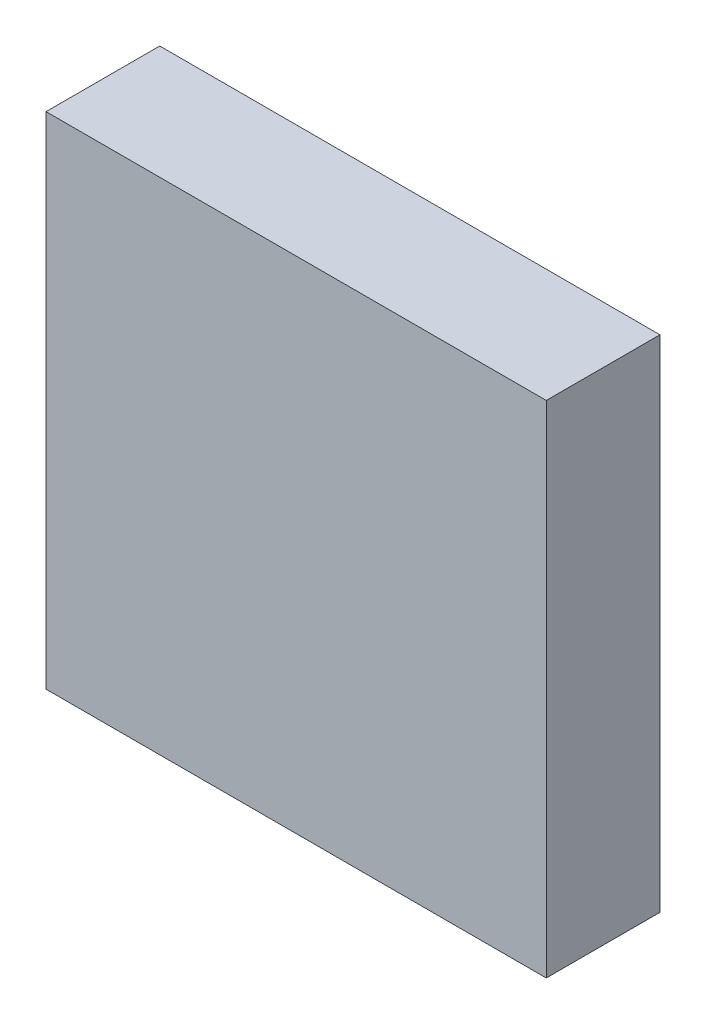
ISO-10303-21;
HEADER;
FILE_DESCRIPTION(('STEP AP214'),'2;1');
FILE_NAME('part.step','',(''),(''),'','','');
FILE_SCHEMA(('AUTOMOTIVE_DESIGN { 1 0 10303 214 1 1 1 1 }'));
ENDSEC;
DATA;
#1=APPLICATION_CONTEXT('core data for automotive mechanical design processes');
#2=APPLICATION_PROTOCOL_DEFINITION('international standard','automotive_design',2000,#1);
#3=PRODUCT_CONTEXT('',#1,'mechanical');
#4=PRODUCT('Part','Part','',(#3));
#5=PRODUCT_RELATED_PRODUCT_CATEGORY('part','',(#4));
#6=PRODUCT_DEFINITION_FORMATION('','',#4);
#7=PRODUCT_DEFINITION_CONTEXT('part definition',#1,'design');
#8=PRODUCT_DEFINITION('design','',#6,#7);
#9=PRODUCT_DEFINITION_SHAPE('','',#8);
#10=(LENGTH_UNIT() NAMED_UNIT(*) SI_UNIT(.MILLI.,.METRE.));
#11=(NAMED_UNIT(*) PLANE_ANGLE_UNIT() SI_UNIT($,.RADIAN.));
#12=(NAMED_UNIT(*) SI_UNIT($,.STERADIAN.) SOLID_ANGLE_UNIT());
#13=UNCERTAINTY_MEASURE_WITH_UNIT(LENGTH_MEASURE(1.E-05),#10,'distance_accuracy_value','');
#14=(GEOMETRIC_REPRESENTATION_CONTEXT(3) GLOBAL_UNCERTAINTY_ASSIGNED_CONTEXT((#13)) GLOBAL_UNIT_ASSIGNED_CONTEXT((#10,
#11,#12)) REPRESENTATION_CONTEXT('',''));
#15=CARTESIAN_POINT('',(0.,0.,0.));
#16=DIRECTION('',(0.,0.,1.));
#17=DIRECTION('',(1.,0.,0.));
#18=AXIS2_PLACEMENT_3D('',#15,#16,#17);
#19=CARTESIAN_POINT('',(5.5,-5.5,1.25));
#20=DIRECTION('',(-1.,0.,0.));
#21=DIRECTION('',(0.,0.,1.));
#22=AXIS2_PLACEMENT_3D('',#19,#20,#21);
#23=PLANE('',#22);
#24=DIRECTION('',(0.,1.,0.));
#25=VECTOR('',#24,1.);
#26=CARTESIAN_POINT('',(5.5,-5.5,-1.25));
#27=LINE('',#26,#25);
#28=CARTESIAN_POINT('',(5.5,-5.5,-1.25));
#29=VERTEX_POINT('',#28);
#30=CARTESIAN_POINT('',(5.5,5.5,-1.25));
#31=VERTEX_POINT('',#30);
#32=EDGE_CURVE('E96',#29,#31,#27,.T.);
#33=ORIENTED_EDGE('',*,*,#32,.T.);
#34=DIRECTION('',(0.,0.,-1.));
#35=VECTOR('',#34,1.);
#36=CARTESIAN_POINT('',(5.5,5.5,1.25));
#37=LINE('',#36,#35);
#38=CARTESIAN_POINT('',(5.5,5.5,1.25));
#39=VERTEX_POINT('',#38);
#40=EDGE_CURVE('E11',#39,#31,#37,.T.);
#41=ORIENTED_EDGE('',*,*,#40,.F.);
#42=DIRECTION('',(0.,1.,0.));
#43=VECTOR('',#42,1.);
#44=CARTESIAN_POINT('',(5.5,-5.5,1.25));
#45=LINE('',#44,#43);
#46=CARTESIAN_POINT('',(5.5,-5.5,1.25));
#47=VERTEX_POINT('',#46);
#48=EDGE_CURVE('E84',#47,#39,#45,.T.);
#49=ORIENTED_EDGE('',*,*,#48,.F.);
#50=DIRECTION('',(0.,0.,-1.));
#51=VECTOR('',#50,1.);
#52=CARTESIAN_POINT('',(5.5,-5.5,1.25));
#53=LINE('',#52,#51);
#54=EDGE_CURVE('E92',#47,#29,#53,.T.);
#55=ORIENTED_EDGE('',*,*,#54,.T.);
#56=EDGE_LOOP('',(#33,#41,#49,#55));
#57=FACE_BOUND('',#56,.T.);
#58=ADVANCED_FACE('F33',(#57),#23,.F.);
#59=CARTESIAN_POINT('',(-5.5,5.5,1.25));
#60=DIRECTION('',(0.,-1.,0.));
#61=DIRECTION('',(0.,0.,-1.));
#62=AXIS2_PLACEMENT_3D('',#59,#60,#61);
#63=PLANE('',#62);
#64=DIRECTION('',(-1.,0.,0.));
#65=VECTOR('',#64,1.);
#66=CARTESIAN_POINT('',(-5.5,5.5,-1.25));
#67=LINE('',#66,#65);
#68=CARTESIAN_POINT('',(-5.5,5.5,-1.25));
#69=VERTEX_POINT('',#68);
#70=EDGE_CURVE('E88',#31,#69,#67,.T.);
#71=ORIENTED_EDGE('',*,*,#70,.T.);
#72=DIRECTION('',(0.,0.,-1.));
#73=VECTOR('',#72,1.);
#74=CARTESIAN_POINT('',(-5.5,5.5,1.25));
#75=LINE('',#74,#73);
#76=CARTESIAN_POINT('',(-5.5,5.5,1.25));
#77=VERTEX_POINT('',#76);
#78=EDGE_CURVE('E41',#77,#69,#75,.T.);
#79=ORIENTED_EDGE('',*,*,#78,.F.);
#80=DIRECTION('',(-1.,0.,0.));
#81=VECTOR('',#80,1.);
#82=CARTESIAN_POINT('',(-5.5,5.5,1.25));
#83=LINE('',#82,#81);
#84=EDGE_CURVE('E79',#39,#77,#83,.T.);
#85=ORIENTED_EDGE('',*,*,#84,.F.);
#86=ORIENTED_EDGE('',*,*,#40,.T.);
#87=EDGE_LOOP('',(#71,#79,#85,#86));
#88=FACE_BOUND('',#87,.T.);
#89=ADVANCED_FACE('F87',(#88),#63,.F.);
#90=CARTESIAN_POINT('',(-5.5,-5.5,1.25));
#91=DIRECTION('',(1.,0.,0.));
#92=DIRECTION('',(0.,0.,-1.));
#93=AXIS2_PLACEMENT_3D('',#90,#91,#92);
#94=PLANE('',#93);
#95=DIRECTION('',(0.,-1.,0.));
#96=VECTOR('',#95,1.);
#97=CARTESIAN_POINT('',(-5.5,-5.5,-1.25));
#98=LINE('',#97,#96);
#99=CARTESIAN_POINT('',(-5.5,-5.5,-1.25));
#100=VERTEX_POINT('',#99);
#101=EDGE_CURVE('E66',#69,#100,#98,.T.);
#102=ORIENTED_EDGE('',*,*,#101,.T.);
#103=DIRECTION('',(0.,0.,-1.));
#104=VECTOR('',#103,1.);
#105=CARTESIAN_POINT('',(-5.5,-5.5,1.25));
#106=LINE('',#105,#104);
#107=CARTESIAN_POINT('',(-5.5,-5.5,1.25));
#108=VERTEX_POINT('',#107);
#109=EDGE_CURVE('E89',#108,#100,#106,.T.);
#110=ORIENTED_EDGE('',*,*,#109,.F.);
#111=DIRECTION('',(0.,-1.,0.));
#112=VECTOR('',#111,1.);
#113=CARTESIAN_POINT('',(-5.5,-5.5,1.25));
#114=LINE('',#113,#112);
#115=EDGE_CURVE('E82',#77,#108,#114,.T.);
#116=ORIENTED_EDGE('',*,*,#115,.F.);
#117=ORIENTED_EDGE('',*,*,#78,.T.);
#118=EDGE_LOOP('',(#102,#110,#116,#117));
#119=FACE_BOUND('',#118,.T.);
#120=ADVANCED_FACE('F90',(#119),#94,.F.);
#121=CARTESIAN_POINT('',(-5.5,-5.5,1.25));
#122=DIRECTION('',(0.,1.,0.));
#123=DIRECTION('',(0.,0.,1.));
#124=AXIS2_PLACEMENT_3D('',#121,#122,#123);
#125=PLANE('',#124);
#126=DIRECTION('',(1.,0.,0.));
#127=VECTOR('',#126,1.);
#128=CARTESIAN_POINT('',(-5.5,-5.5,-1.25));
#129=LINE('',#128,#127);
#130=EDGE_CURVE('E72',#100,#29,#129,.T.);
#131=ORIENTED_EDGE('',*,*,#130,.T.);
#132=ORIENTED_EDGE('',*,*,#54,.F.);
#133=DIRECTION('',(1.,0.,0.));
#134=VECTOR('',#133,1.);
#135=CARTESIAN_POINT('',(-5.5,-5.5,1.25));
#136=LINE('',#135,#134);
#137=EDGE_CURVE('E49',#108,#47,#136,.T.);
#138=ORIENTED_EDGE('',*,*,#137,.F.);
#139=ORIENTED_EDGE('',*,*,#109,.T.);
#140=EDGE_LOOP('',(#131,#132,#138,#139));
#141=FACE_BOUND('',#140,.T.);
#142=ADVANCED_FACE('F103',(#141),#125,.F.);
#143=CARTESIAN_POINT('',(0.,0.,1.25));
#144=DIRECTION('',(0.,0.,-1.));
#145=DIRECTION('',(-1.,0.,0.));
#146=AXIS2_PLACEMENT_3D('',#143,#144,#145);
#147=PLANE('',#146);
#148=ORIENTED_EDGE('',*,*,#48,.T.);
#149=ORIENTED_EDGE('',*,*,#84,.T.);
#150=ORIENTED_EDGE('',*,*,#115,.T.);
#151=ORIENTED_EDGE('',*,*,#137,.T.);
#152=EDGE_LOOP('',(#148,#149,#150,#151));
#153=FACE_BOUND('',#152,.T.);
#154=ADVANCED_FACE('F80',(#153),#147,.F.);
#155=CARTESIAN_POINT('',(0.,0.,-1.25));
#156=DIRECTION('',(0.,0.,-1.));
#157=DIRECTION('',(-1.,0.,0.));
#158=AXIS2_PLACEMENT_3D('',#155,#156,#157);
#159=PLANE('',#158);
#160=ORIENTED_EDGE('',*,*,#32,.F.);
#161=ORIENTED_EDGE('',*,*,#130,.F.);
#162=ORIENTED_EDGE('',*,*,#101,.F.);
#163=ORIENTED_EDGE('',*,*,#70,.F.);
#164=EDGE_LOOP('',(#160,#161,#162,#163));
#165=FACE_BOUND('',#164,.T.);
#166=ADVANCED_FACE('F106',(#165),#159,.T.);
#167=CLOSED_SHELL('',(#58,#89,#120,#142,#154,#166));
#168=MANIFOLD_SOLID_BREP('B2',#167);
#169=ADVANCED_BREP_SHAPE_REPRESENTATION('',(#18,#168),#14);
#170=SHAPE_DEFINITION_REPRESENTATION(#9,#169);
ENDSEC;
END-ISO-10303-21;
